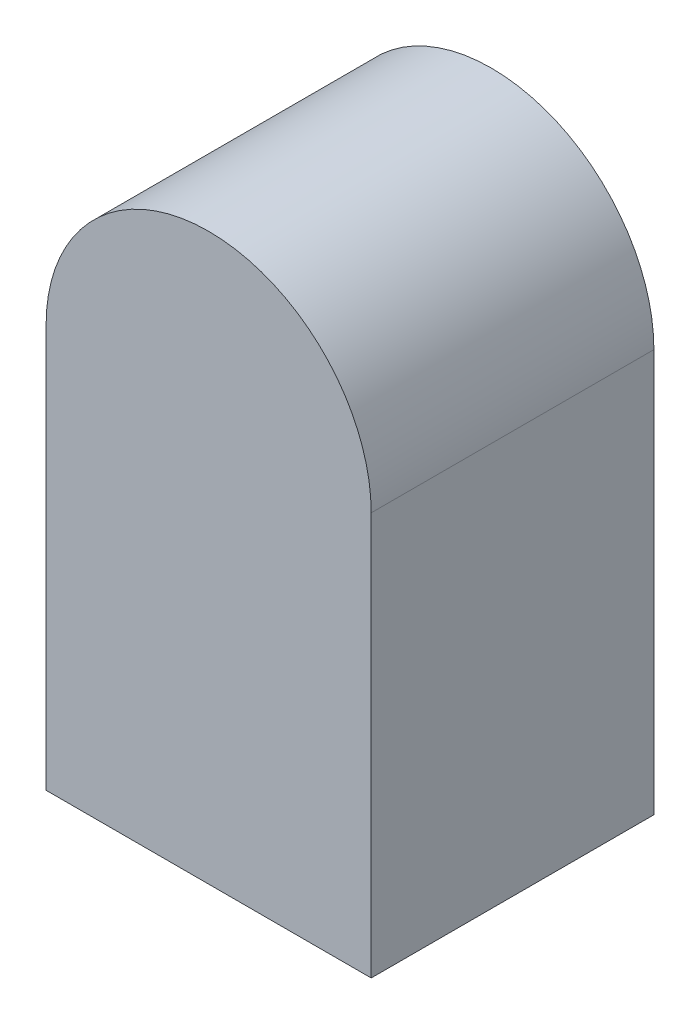
ISO-10303-21;
HEADER;
FILE_DESCRIPTION(('STEP AP214'),'2;1');
FILE_NAME('part.step','',(''),(''),'','','');
FILE_SCHEMA(('AUTOMOTIVE_DESIGN { 1 0 10303 214 1 1 1 1 }'));
ENDSEC;
DATA;
#1=APPLICATION_CONTEXT('core data for automotive mechanical design processes');
#2=APPLICATION_PROTOCOL_DEFINITION('international standard','automotive_design',2000,#1);
#3=PRODUCT_CONTEXT('',#1,'mechanical');
#4=PRODUCT('Part','Part','',(#3));
#5=PRODUCT_RELATED_PRODUCT_CATEGORY('part','',(#4));
#6=PRODUCT_DEFINITION_FORMATION('','',#4);
#7=PRODUCT_DEFINITION_CONTEXT('part definition',#1,'design');
#8=PRODUCT_DEFINITION('design','',#6,#7);
#9=PRODUCT_DEFINITION_SHAPE('','',#8);
#10=(LENGTH_UNIT() NAMED_UNIT(*) SI_UNIT(.MILLI.,.METRE.));
#11=(NAMED_UNIT(*) PLANE_ANGLE_UNIT() SI_UNIT($,.RADIAN.));
#12=(NAMED_UNIT(*) SI_UNIT($,.STERADIAN.) SOLID_ANGLE_UNIT());
#13=UNCERTAINTY_MEASURE_WITH_UNIT(LENGTH_MEASURE(1.E-05),#10,'distance_accuracy_value','');
#14=(GEOMETRIC_REPRESENTATION_CONTEXT(3) GLOBAL_UNCERTAINTY_ASSIGNED_CONTEXT((#13)) GLOBAL_UNIT_ASSIGNED_CONTEXT((#10,
#11,#12)) REPRESENTATION_CONTEXT('',''));
#15=CARTESIAN_POINT('',(0.,0.,0.));
#16=DIRECTION('',(0.,0.,1.));
#17=DIRECTION('',(1.,0.,0.));
#18=AXIS2_PLACEMENT_3D('',#15,#16,#17);
#19=CARTESIAN_POINT('',(-1.75,-2.8335240809167,0.2));
#20=DIRECTION('',(0.,0.,1.));
#21=DIRECTION('',(1.,0.,0.));
#22=AXIS2_PLACEMENT_3D('',#19,#20,#21);
#23=PLANE('',#22);
#24=DIRECTION('',(0.,-1.,0.));
#25=VECTOR('',#24,1.);
#26=CARTESIAN_POINT('',(-1.865,-2.715,0.2));
#27=LINE('',#26,#25);
#28=CARTESIAN_POINT('',(-1.865,-2.715,0.2));
#29=VERTEX_POINT('',#28);
#30=CARTESIAN_POINT('',(-1.865,-3.,0.2));
#31=VERTEX_POINT('',#30);
#32=EDGE_CURVE('E11',#29,#31,#27,.T.);
#33=ORIENTED_EDGE('',*,*,#32,.T.);
#34=DIRECTION('',(1.,0.,0.));
#35=VECTOR('',#34,1.);
#36=CARTESIAN_POINT('',(-2.375,-3.,0.2));
#37=LINE('',#36,#35);
#38=CARTESIAN_POINT('',(-1.635,-3.,0.2));
#39=VERTEX_POINT('',#38);
#40=EDGE_CURVE('E24',#31,#39,#37,.T.);
#41=ORIENTED_EDGE('',*,*,#40,.T.);
#42=DIRECTION('',(0.,1.,0.));
#43=VECTOR('',#42,1.);
#44=CARTESIAN_POINT('',(-1.635,-3.,0.2));
#45=LINE('',#44,#43);
#46=CARTESIAN_POINT('',(-1.635,-2.715,0.2));
#47=VERTEX_POINT('',#46);
#48=EDGE_CURVE('E88',#39,#47,#45,.T.);
#49=ORIENTED_EDGE('',*,*,#48,.T.);
#50=CARTESIAN_POINT('',(-1.75,-2.715,0.2));
#51=DIRECTION('',(0.,0.,1.));
#52=DIRECTION('',(1.,0.,0.));
#53=AXIS2_PLACEMENT_3D('',#50,#51,#52);
#54=CIRCLE('',#53,0.115);
#55=EDGE_CURVE('E70',#47,#29,#54,.T.);
#56=ORIENTED_EDGE('',*,*,#55,.T.);
#57=EDGE_LOOP('',(#33,#41,#49,#56));
#58=FACE_BOUND('',#57,.T.);
#59=ADVANCED_FACE('F17',(#58),#23,.T.);
#60=CARTESIAN_POINT('',(-3.,-3.,0.));
#61=DIRECTION('',(0.,-1.,0.));
#62=DIRECTION('',(1.,0.,0.));
#63=AXIS2_PLACEMENT_3D('',#60,#61,#62);
#64=PLANE('',#63);
#65=DIRECTION('',(0.,0.,-1.));
#66=VECTOR('',#65,1.);
#67=CARTESIAN_POINT('',(-1.635,-3.,0.));
#68=LINE('',#67,#66);
#69=CARTESIAN_POINT('',(-1.635,-3.,0.));
#70=VERTEX_POINT('',#69);
#71=EDGE_CURVE('E76',#39,#70,#68,.T.);
#72=ORIENTED_EDGE('',*,*,#71,.F.);
#73=ORIENTED_EDGE('',*,*,#40,.F.);
#74=DIRECTION('',(0.,0.,1.));
#75=VECTOR('',#74,1.);
#76=CARTESIAN_POINT('',(-1.865,-3.,0.));
#77=LINE('',#76,#75);
#78=CARTESIAN_POINT('',(-1.865,-3.,0.));
#79=VERTEX_POINT('',#78);
#80=EDGE_CURVE('E84',#79,#31,#77,.T.);
#81=ORIENTED_EDGE('',*,*,#80,.F.);
#82=DIRECTION('',(1.,0.,0.));
#83=VECTOR('',#82,1.);
#84=CARTESIAN_POINT('',(-1.865,-3.,0.));
#85=LINE('',#84,#83);
#86=EDGE_CURVE('E82',#79,#70,#85,.T.);
#87=ORIENTED_EDGE('',*,*,#86,.T.);
#88=EDGE_LOOP('',(#72,#73,#81,#87));
#89=FACE_BOUND('',#88,.T.);
#90=ADVANCED_FACE('F90',(#89),#64,.T.);
#91=CARTESIAN_POINT('',(-1.865,-2.715,0.));
#92=DIRECTION('',(-1.,0.,0.));
#93=DIRECTION('',(0.,-1.,0.));
#94=AXIS2_PLACEMENT_3D('',#91,#92,#93);
#95=PLANE('',#94);
#96=DIRECTION('',(0.,-1.,0.));
#97=VECTOR('',#96,1.);
#98=CARTESIAN_POINT('',(-1.865,-2.715,0.));
#99=LINE('',#98,#97);
#100=CARTESIAN_POINT('',(-1.865,-2.715,0.));
#101=VERTEX_POINT('',#100);
#102=EDGE_CURVE('E61',#101,#79,#99,.T.);
#103=ORIENTED_EDGE('',*,*,#102,.T.);
#104=ORIENTED_EDGE('',*,*,#80,.T.);
#105=ORIENTED_EDGE('',*,*,#32,.F.);
#106=DIRECTION('',(0.,0.,1.));
#107=VECTOR('',#106,1.);
#108=CARTESIAN_POINT('',(-1.865,-2.715,0.));
#109=LINE('',#108,#107);
#110=EDGE_CURVE('E64',#101,#29,#109,.T.);
#111=ORIENTED_EDGE('',*,*,#110,.F.);
#112=EDGE_LOOP('',(#103,#104,#105,#111));
#113=FACE_BOUND('',#112,.T.);
#114=ADVANCED_FACE('F91',(#113),#95,.T.);
#115=CARTESIAN_POINT('',(-1.75,-2.715,0.));
#116=DIRECTION('',(0.,0.,1.));
#117=DIRECTION('',(1.,0.,0.));
#118=AXIS2_PLACEMENT_3D('',#115,#116,#117);
#119=CYLINDRICAL_SURFACE('',#118,0.115);
#120=CARTESIAN_POINT('',(-1.75,-2.715,0.));
#121=DIRECTION('',(0.,0.,1.));
#122=DIRECTION('',(1.,0.,0.));
#123=AXIS2_PLACEMENT_3D('',#120,#121,#122);
#124=CIRCLE('',#123,0.115);
#125=CARTESIAN_POINT('',(-1.635,-2.715,0.));
#126=VERTEX_POINT('',#125);
#127=EDGE_CURVE('E54',#126,#101,#124,.T.);
#128=ORIENTED_EDGE('',*,*,#127,.T.);
#129=ORIENTED_EDGE('',*,*,#110,.T.);
#130=ORIENTED_EDGE('',*,*,#55,.F.);
#131=DIRECTION('',(0.,0.,1.));
#132=VECTOR('',#131,1.);
#133=CARTESIAN_POINT('',(-1.635,-2.715,0.));
#134=LINE('',#133,#132);
#135=EDGE_CURVE('E65',#126,#47,#134,.T.);
#136=ORIENTED_EDGE('',*,*,#135,.F.);
#137=EDGE_LOOP('',(#128,#129,#130,#136));
#138=FACE_BOUND('',#137,.T.);
#139=ADVANCED_FACE('F69',(#138),#119,.T.);
#140=CARTESIAN_POINT('',(-1.635,-3.,0.));
#141=DIRECTION('',(1.,0.,0.));
#142=DIRECTION('',(0.,1.,0.));
#143=AXIS2_PLACEMENT_3D('',#140,#141,#142);
#144=PLANE('',#143);
#145=DIRECTION('',(0.,1.,0.));
#146=VECTOR('',#145,1.);
#147=CARTESIAN_POINT('',(-1.635,-3.,0.));
#148=LINE('',#147,#146);
#149=EDGE_CURVE('E59',#70,#126,#148,.T.);
#150=ORIENTED_EDGE('',*,*,#149,.T.);
#151=ORIENTED_EDGE('',*,*,#135,.T.);
#152=ORIENTED_EDGE('',*,*,#48,.F.);
#153=ORIENTED_EDGE('',*,*,#71,.T.);
#154=EDGE_LOOP('',(#150,#151,#152,#153));
#155=FACE_BOUND('',#154,.T.);
#156=ADVANCED_FACE('F74',(#155),#144,.T.);
#157=CARTESIAN_POINT('',(-1.75,-2.8335265642716,0.));
#158=DIRECTION('',(0.,0.,1.));
#159=DIRECTION('',(0.,1.,0.));
#160=AXIS2_PLACEMENT_3D('',#157,#158,#159);
#161=PLANE('',#160);
#162=ORIENTED_EDGE('',*,*,#86,.F.);
#163=ORIENTED_EDGE('',*,*,#102,.F.);
#164=ORIENTED_EDGE('',*,*,#127,.F.);
#165=ORIENTED_EDGE('',*,*,#149,.F.);
#166=EDGE_LOOP('',(#162,#163,#164,#165));
#167=FACE_BOUND('',#166,.T.);
#168=ADVANCED_FACE('F57',(#167),#161,.F.);
#169=CLOSED_SHELL('',(#59,#90,#114,#139,#156,#168));
#170=MANIFOLD_SOLID_BREP('B1',#169);
#171=ADVANCED_BREP_SHAPE_REPRESENTATION('',(#18,#170),#14);
#172=SHAPE_DEFINITION_REPRESENTATION(#9,#171);
ENDSEC;
END-ISO-10303-21;
